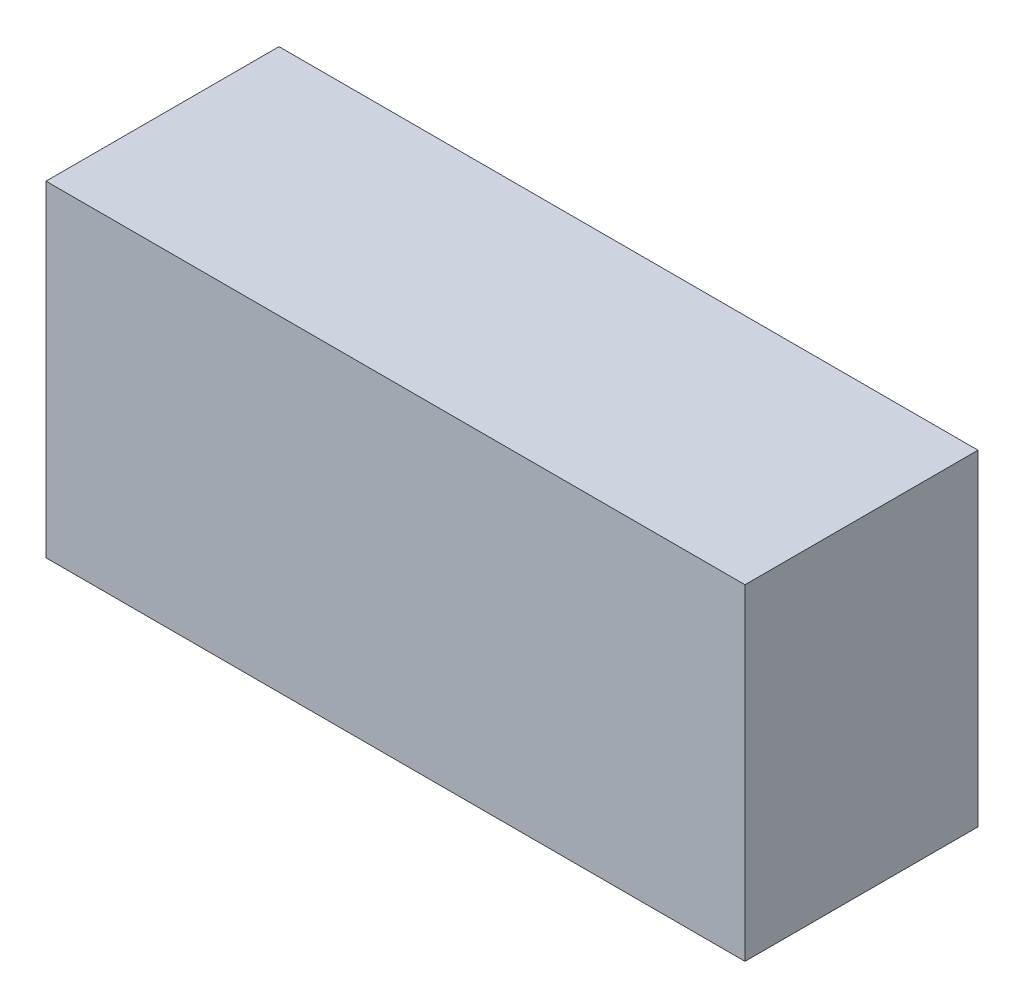
ISO-10303-21;
HEADER;
FILE_DESCRIPTION(('STEP AP214'),'2;1');
FILE_NAME('part.step','',(''),(''),'','','');
FILE_SCHEMA(('AUTOMOTIVE_DESIGN { 1 0 10303 214 1 1 1 1 }'));
ENDSEC;
DATA;
#1=APPLICATION_CONTEXT('core data for automotive mechanical design processes');
#2=APPLICATION_PROTOCOL_DEFINITION('international standard','automotive_design',2000,#1);
#3=PRODUCT_CONTEXT('',#1,'mechanical');
#4=PRODUCT('Part','Part','',(#3));
#5=PRODUCT_RELATED_PRODUCT_CATEGORY('part','',(#4));
#6=PRODUCT_DEFINITION_FORMATION('','',#4);
#7=PRODUCT_DEFINITION_CONTEXT('part definition',#1,'design');
#8=PRODUCT_DEFINITION('design','',#6,#7);
#9=PRODUCT_DEFINITION_SHAPE('','',#8);
#10=(LENGTH_UNIT() NAMED_UNIT(*) SI_UNIT(.MILLI.,.METRE.));
#11=(NAMED_UNIT(*) PLANE_ANGLE_UNIT() SI_UNIT($,.RADIAN.));
#12=(NAMED_UNIT(*) SI_UNIT($,.STERADIAN.) SOLID_ANGLE_UNIT());
#13=UNCERTAINTY_MEASURE_WITH_UNIT(LENGTH_MEASURE(1.E-05),#10,'distance_accuracy_value','');
#14=(GEOMETRIC_REPRESENTATION_CONTEXT(3) GLOBAL_UNCERTAINTY_ASSIGNED_CONTEXT((#13)) GLOBAL_UNIT_ASSIGNED_CONTEXT((#10,
#11,#12)) REPRESENTATION_CONTEXT('',''));
#15=CARTESIAN_POINT('',(0.,0.,0.));
#16=DIRECTION('',(0.,0.,1.));
#17=DIRECTION('',(1.,0.,0.));
#18=AXIS2_PLACEMENT_3D('',#15,#16,#17);
#19=CARTESIAN_POINT('',(1.49999954,0.70000114,0.));
#20=DIRECTION('',(0.,-1.,0.));
#21=DIRECTION('',(-1.,0.,0.));
#22=AXIS2_PLACEMENT_3D('',#19,#20,#21);
#23=PLANE('',#22);
#24=DIRECTION('',(-1.,0.,0.));
#25=VECTOR('',#24,1.);
#26=CARTESIAN_POINT('',(1.49999954,0.70000114,0.));
#27=LINE('',#26,#25);
#28=CARTESIAN_POINT('',(1.49999954,0.70000114,0.));
#29=VERTEX_POINT('',#28);
#30=CARTESIAN_POINT('',(-1.49999954,0.70000114,0.));
#31=VERTEX_POINT('',#30);
#32=EDGE_CURVE('E11',#29,#31,#27,.T.);
#33=ORIENTED_EDGE('',*,*,#32,.T.);
#34=DIRECTION('',(0.,0.,1.));
#35=VECTOR('',#34,1.);
#36=CARTESIAN_POINT('',(-1.49999954,0.70000114,0.));
#37=LINE('',#36,#35);
#38=CARTESIAN_POINT('',(-1.49999954,0.70000114,1.00000054));
#39=VERTEX_POINT('',#38);
#40=EDGE_CURVE('E23',#31,#39,#37,.T.);
#41=ORIENTED_EDGE('',*,*,#40,.T.);
#42=DIRECTION('',(-1.,0.,0.));
#43=VECTOR('',#42,1.);
#44=CARTESIAN_POINT('',(1.49999954,0.70000114,1.00000054));
#45=LINE('',#44,#43);
#46=CARTESIAN_POINT('',(1.49999954,0.70000114,1.00000054));
#47=VERTEX_POINT('',#46);
#48=EDGE_CURVE('E86',#47,#39,#45,.T.);
#49=ORIENTED_EDGE('',*,*,#48,.F.);
#50=DIRECTION('',(0.,0.,1.));
#51=VECTOR('',#50,1.);
#52=CARTESIAN_POINT('',(1.49999954,0.70000114,0.));
#53=LINE('',#52,#51);
#54=EDGE_CURVE('E35',#29,#47,#53,.T.);
#55=ORIENTED_EDGE('',*,*,#54,.F.);
#56=EDGE_LOOP('',(#33,#41,#49,#55));
#57=FACE_BOUND('',#56,.T.);
#58=ADVANCED_FACE('F16',(#57),#23,.F.);
#59=CARTESIAN_POINT('',(-1.49999954,0.70000114,0.));
#60=DIRECTION('',(1.,0.,0.));
#61=DIRECTION('',(0.,-1.,0.));
#62=AXIS2_PLACEMENT_3D('',#59,#60,#61);
#63=PLANE('',#62);
#64=DIRECTION('',(0.,-1.,0.));
#65=VECTOR('',#64,1.);
#66=CARTESIAN_POINT('',(-1.49999954,0.70000114,0.));
#67=LINE('',#66,#65);
#68=CARTESIAN_POINT('',(-1.49999954,-0.6999986,0.));
#69=VERTEX_POINT('',#68);
#70=EDGE_CURVE('E83',#31,#69,#67,.T.);
#71=ORIENTED_EDGE('',*,*,#70,.T.);
#72=DIRECTION('',(0.,0.,1.));
#73=VECTOR('',#72,1.);
#74=CARTESIAN_POINT('',(-1.49999954,-0.6999986,0.));
#75=LINE('',#74,#73);
#76=CARTESIAN_POINT('',(-1.49999954,-0.6999986,1.00000054));
#77=VERTEX_POINT('',#76);
#78=EDGE_CURVE('E81',#69,#77,#75,.T.);
#79=ORIENTED_EDGE('',*,*,#78,.T.);
#80=DIRECTION('',(0.,-1.,0.));
#81=VECTOR('',#80,1.);
#82=CARTESIAN_POINT('',(-1.49999954,0.70000114,1.00000054));
#83=LINE('',#82,#81);
#84=EDGE_CURVE('E61',#39,#77,#83,.T.);
#85=ORIENTED_EDGE('',*,*,#84,.F.);
#86=ORIENTED_EDGE('',*,*,#40,.F.);
#87=EDGE_LOOP('',(#71,#79,#85,#86));
#88=FACE_BOUND('',#87,.T.);
#89=ADVANCED_FACE('F88',(#88),#63,.F.);
#90=CARTESIAN_POINT('',(-1.49999954,-0.6999986,0.));
#91=DIRECTION('',(0.,1.,0.));
#92=DIRECTION('',(1.,0.,0.));
#93=AXIS2_PLACEMENT_3D('',#90,#91,#92);
#94=PLANE('',#93);
#95=DIRECTION('',(1.,0.,0.));
#96=VECTOR('',#95,1.);
#97=CARTESIAN_POINT('',(-1.49999954,-0.6999986,0.));
#98=LINE('',#97,#96);
#99=CARTESIAN_POINT('',(1.49999954,-0.6999986,0.));
#100=VERTEX_POINT('',#99);
#101=EDGE_CURVE('E70',#69,#100,#98,.T.);
#102=ORIENTED_EDGE('',*,*,#101,.T.);
#103=DIRECTION('',(0.,0.,1.));
#104=VECTOR('',#103,1.);
#105=CARTESIAN_POINT('',(1.49999954,-0.6999986,0.));
#106=LINE('',#105,#104);
#107=CARTESIAN_POINT('',(1.49999954,-0.6999986,1.00000054));
#108=VERTEX_POINT('',#107);
#109=EDGE_CURVE('E64',#100,#108,#106,.T.);
#110=ORIENTED_EDGE('',*,*,#109,.T.);
#111=DIRECTION('',(1.,0.,0.));
#112=VECTOR('',#111,1.);
#113=CARTESIAN_POINT('',(-1.49999954,-0.6999986,1.00000054));
#114=LINE('',#113,#112);
#115=EDGE_CURVE('E56',#77,#108,#114,.T.);
#116=ORIENTED_EDGE('',*,*,#115,.F.);
#117=ORIENTED_EDGE('',*,*,#78,.F.);
#118=EDGE_LOOP('',(#102,#110,#116,#117));
#119=FACE_BOUND('',#118,.T.);
#120=ADVANCED_FACE('F68',(#119),#94,.F.);
#121=CARTESIAN_POINT('',(1.49999954,-0.6999986,0.));
#122=DIRECTION('',(-1.,0.,0.));
#123=DIRECTION('',(0.,1.,0.));
#124=AXIS2_PLACEMENT_3D('',#121,#122,#123);
#125=PLANE('',#124);
#126=DIRECTION('',(0.,1.,0.));
#127=VECTOR('',#126,1.);
#128=CARTESIAN_POINT('',(1.49999954,-0.6999986,0.));
#129=LINE('',#128,#127);
#130=EDGE_CURVE('E65',#100,#29,#129,.T.);
#131=ORIENTED_EDGE('',*,*,#130,.T.);
#132=ORIENTED_EDGE('',*,*,#54,.T.);
#133=DIRECTION('',(0.,1.,0.));
#134=VECTOR('',#133,1.);
#135=CARTESIAN_POINT('',(1.49999954,-0.6999986,1.00000054));
#136=LINE('',#135,#134);
#137=EDGE_CURVE('E60',#108,#47,#136,.T.);
#138=ORIENTED_EDGE('',*,*,#137,.F.);
#139=ORIENTED_EDGE('',*,*,#109,.F.);
#140=EDGE_LOOP('',(#131,#132,#138,#139));
#141=FACE_BOUND('',#140,.T.);
#142=ADVANCED_FACE('F75',(#141),#125,.F.);
#143=CARTESIAN_POINT('',(1.49999954,0.70000114,0.));
#144=DIRECTION('',(0.,0.,-1.));
#145=DIRECTION('',(-1.,0.,0.));
#146=AXIS2_PLACEMENT_3D('',#143,#144,#145);
#147=PLANE('',#146);
#148=ORIENTED_EDGE('',*,*,#130,.F.);
#149=ORIENTED_EDGE('',*,*,#101,.F.);
#150=ORIENTED_EDGE('',*,*,#70,.F.);
#151=ORIENTED_EDGE('',*,*,#32,.F.);
#152=EDGE_LOOP('',(#148,#149,#150,#151));
#153=FACE_BOUND('',#152,.T.);
#154=ADVANCED_FACE('F90',(#153),#147,.T.);
#155=CARTESIAN_POINT('',(1.49999954,0.70000114,1.00000054));
#156=DIRECTION('',(0.,0.,-1.));
#157=DIRECTION('',(-1.,0.,0.));
#158=AXIS2_PLACEMENT_3D('',#155,#156,#157);
#159=PLANE('',#158);
#160=ORIENTED_EDGE('',*,*,#48,.T.);
#161=ORIENTED_EDGE('',*,*,#84,.T.);
#162=ORIENTED_EDGE('',*,*,#115,.T.);
#163=ORIENTED_EDGE('',*,*,#137,.T.);
#164=EDGE_LOOP('',(#160,#161,#162,#163));
#165=FACE_BOUND('',#164,.T.);
#166=ADVANCED_FACE('F58',(#165),#159,.F.);
#167=CLOSED_SHELL('',(#58,#89,#120,#142,#154,#166));
#168=MANIFOLD_SOLID_BREP('B1',#167);
#169=ADVANCED_BREP_SHAPE_REPRESENTATION('',(#18,#168),#14);
#170=SHAPE_DEFINITION_REPRESENTATION(#9,#169);
ENDSEC;
END-ISO-10303-21;
